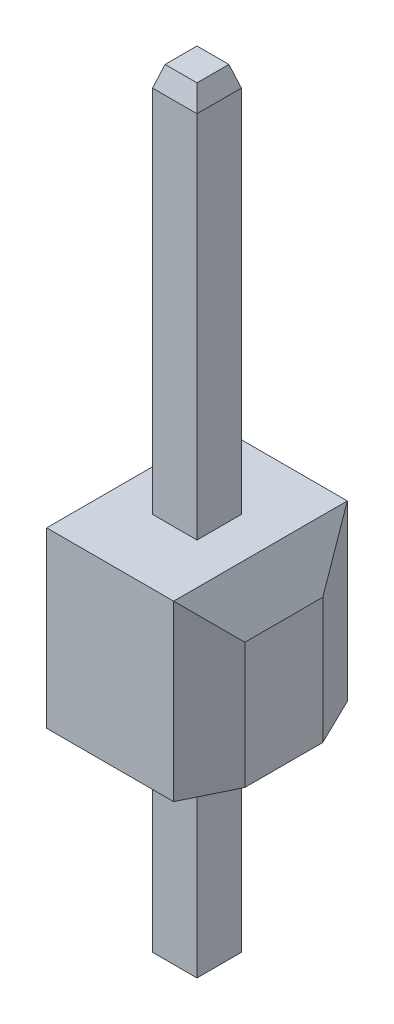
ISO-10303-21;
HEADER;
FILE_DESCRIPTION(('STEP AP214'),'2;1');
FILE_NAME('part.step','',(''),(''),'','','');
FILE_SCHEMA(('AUTOMOTIVE_DESIGN { 1 0 10303 214 1 1 1 1 }'));
ENDSEC;
DATA;
#1=APPLICATION_CONTEXT('core data for automotive mechanical design processes');
#2=APPLICATION_PROTOCOL_DEFINITION('international standard','automotive_design',2000,#1);
#3=PRODUCT_CONTEXT('',#1,'mechanical');
#4=PRODUCT('Part','Part','',(#3));
#5=PRODUCT_RELATED_PRODUCT_CATEGORY('part','',(#4));
#6=PRODUCT_DEFINITION_FORMATION('','',#4);
#7=PRODUCT_DEFINITION_CONTEXT('part definition',#1,'design');
#8=PRODUCT_DEFINITION('design','',#6,#7);
#9=PRODUCT_DEFINITION_SHAPE('','',#8);
#10=(LENGTH_UNIT() NAMED_UNIT(*) SI_UNIT(.MILLI.,.METRE.));
#11=(NAMED_UNIT(*) PLANE_ANGLE_UNIT() SI_UNIT($,.RADIAN.));
#12=(NAMED_UNIT(*) SI_UNIT($,.STERADIAN.) SOLID_ANGLE_UNIT());
#13=UNCERTAINTY_MEASURE_WITH_UNIT(LENGTH_MEASURE(1.E-05),#10,'distance_accuracy_value','');
#14=(GEOMETRIC_REPRESENTATION_CONTEXT(3) GLOBAL_UNCERTAINTY_ASSIGNED_CONTEXT((#13)) GLOBAL_UNIT_ASSIGNED_CONTEXT((#10,
#11,#12)) REPRESENTATION_CONTEXT('',''));
#15=CARTESIAN_POINT('',(0.,0.,0.));
#16=DIRECTION('',(0.,0.,1.));
#17=DIRECTION('',(1.,0.,0.));
#18=AXIS2_PLACEMENT_3D('',#15,#16,#17);
#19=CARTESIAN_POINT('',(1.27,2.54,1.27));
#20=DIRECTION('',(-1.,0.,0.));
#21=DIRECTION('',(0.,0.,1.));
#22=AXIS2_PLACEMENT_3D('',#19,#20,#21);
#23=PLANE('',#22);
#24=DIRECTION('',(0.,0.,-1.));
#25=VECTOR('',#24,1.);
#26=CARTESIAN_POINT('',(1.27,0.,1.27));
#27=LINE('',#26,#25);
#28=CARTESIAN_POINT('',(1.27,0.,0.569999999999992));
#29=VERTEX_POINT('',#28);
#30=CARTESIAN_POINT('',(1.27,0.,-0.569999999999992));
#31=VERTEX_POINT('',#30);
#32=EDGE_CURVE('E205',#29,#31,#27,.T.);
#33=ORIENTED_EDGE('',*,*,#32,.T.);
#34=DIRECTION('',(0.,1.,0.));
#35=VECTOR('',#34,1.);
#36=CARTESIAN_POINT('',(1.27,2.54,-0.569999999999992));
#37=LINE('',#36,#35);
#38=CARTESIAN_POINT('',(1.27,1.83999999999999,-0.569999999999992));
#39=VERTEX_POINT('',#38);
#40=EDGE_CURVE('E299',#31,#39,#37,.T.);
#41=ORIENTED_EDGE('',*,*,#40,.T.);
#42=DIRECTION('',(0.,0.,1.));
#43=VECTOR('',#42,1.);
#44=CARTESIAN_POINT('',(1.27,1.83999999999999,1.27));
#45=LINE('',#44,#43);
#46=CARTESIAN_POINT('',(1.27,1.83999999999999,0.569999999999992));
#47=VERTEX_POINT('',#46);
#48=EDGE_CURVE('E295',#39,#47,#45,.T.);
#49=ORIENTED_EDGE('',*,*,#48,.T.);
#50=DIRECTION('',(0.,-1.,0.));
#51=VECTOR('',#50,1.);
#52=CARTESIAN_POINT('',(1.27,2.54,0.569999999999992));
#53=LINE('',#52,#51);
#54=EDGE_CURVE('E297',#47,#29,#53,.T.);
#55=ORIENTED_EDGE('',*,*,#54,.T.);
#56=EDGE_LOOP('',(#33,#41,#49,#55));
#57=FACE_BOUND('',#56,.T.);
#58=ADVANCED_FACE('F34',(#57),#23,.F.);
#59=CARTESIAN_POINT('',(-1.27,2.54,-1.27));
#60=DIRECTION('',(0.,0.,1.));
#61=DIRECTION('',(1.,0.,0.));
#62=AXIS2_PLACEMENT_3D('',#59,#60,#61);
#63=PLANE('',#62);
#64=DIRECTION('',(-1.,0.,0.));
#65=VECTOR('',#64,1.);
#66=CARTESIAN_POINT('',(-1.27,0.,-1.27));
#67=LINE('',#66,#65);
#68=CARTESIAN_POINT('',(0.928587188003895,0.,-1.27));
#69=VERTEX_POINT('',#68);
#70=CARTESIAN_POINT('',(-0.928587188003895,0.,-1.27));
#71=VERTEX_POINT('',#70);
#72=EDGE_CURVE('E214',#69,#71,#67,.T.);
#73=ORIENTED_EDGE('',*,*,#72,.T.);
#74=DIRECTION('',(0.,1.,0.));
#75=VECTOR('',#74,1.);
#76=CARTESIAN_POINT('',(-0.928587188003895,2.54,-1.27));
#77=LINE('',#76,#75);
#78=CARTESIAN_POINT('',(-0.928587188003895,2.54,-1.27));
#79=VERTEX_POINT('',#78);
#80=EDGE_CURVE('E57',#71,#79,#77,.T.);
#81=ORIENTED_EDGE('',*,*,#80,.T.);
#82=DIRECTION('',(-1.,0.,0.));
#83=VECTOR('',#82,1.);
#84=CARTESIAN_POINT('',(-1.27,2.54,-1.27));
#85=LINE('',#84,#83);
#86=CARTESIAN_POINT('',(0.928587188003895,2.54,-1.27));
#87=VERTEX_POINT('',#86);
#88=EDGE_CURVE('E206',#87,#79,#85,.T.);
#89=ORIENTED_EDGE('',*,*,#88,.F.);
#90=DIRECTION('',(0.,-1.,0.));
#91=VECTOR('',#90,1.);
#92=CARTESIAN_POINT('',(0.928587188003895,2.54,-1.27));
#93=LINE('',#92,#91);
#94=EDGE_CURVE('E266',#87,#69,#93,.T.);
#95=ORIENTED_EDGE('',*,*,#94,.T.);
#96=EDGE_LOOP('',(#73,#81,#89,#95));
#97=FACE_BOUND('',#96,.T.);
#98=ADVANCED_FACE('F356',(#97),#63,.F.);
#99=CARTESIAN_POINT('',(-1.27,2.54,1.27));
#100=DIRECTION('',(1.,0.,0.));
#101=DIRECTION('',(0.,0.,-1.));
#102=AXIS2_PLACEMENT_3D('',#99,#100,#101);
#103=PLANE('',#102);
#104=DIRECTION('',(0.,0.,-1.));
#105=VECTOR('',#104,1.);
#106=CARTESIAN_POINT('',(-1.27,1.83999999999999,1.27));
#107=LINE('',#106,#105);
#108=CARTESIAN_POINT('',(-1.27,1.83999999999999,0.569999999999992));
#109=VERTEX_POINT('',#108);
#110=CARTESIAN_POINT('',(-1.27,1.83999999999999,-0.569999999999992));
#111=VERTEX_POINT('',#110);
#112=EDGE_CURVE('E306',#109,#111,#107,.T.);
#113=ORIENTED_EDGE('',*,*,#112,.T.);
#114=DIRECTION('',(0.,-1.,0.));
#115=VECTOR('',#114,1.);
#116=CARTESIAN_POINT('',(-1.27,2.54,-0.569999999999992));
#117=LINE('',#116,#115);
#118=CARTESIAN_POINT('',(-1.27,0.,-0.569999999999992));
#119=VERTEX_POINT('',#118);
#120=EDGE_CURVE('E315',#111,#119,#117,.T.);
#121=ORIENTED_EDGE('',*,*,#120,.T.);
#122=DIRECTION('',(0.,0.,1.));
#123=VECTOR('',#122,1.);
#124=CARTESIAN_POINT('',(-1.27,0.,1.27));
#125=LINE('',#124,#123);
#126=CARTESIAN_POINT('',(-1.27,0.,0.569999999999992));
#127=VERTEX_POINT('',#126);
#128=EDGE_CURVE('E216',#119,#127,#125,.T.);
#129=ORIENTED_EDGE('',*,*,#128,.T.);
#130=DIRECTION('',(0.,1.,0.));
#131=VECTOR('',#130,1.);
#132=CARTESIAN_POINT('',(-1.27,2.54,0.569999999999992));
#133=LINE('',#132,#131);
#134=EDGE_CURVE('E313',#127,#109,#133,.T.);
#135=ORIENTED_EDGE('',*,*,#134,.T.);
#136=EDGE_LOOP('',(#113,#121,#129,#135));
#137=FACE_BOUND('',#136,.T.);
#138=ADVANCED_FACE('F361',(#137),#103,.F.);
#139=CARTESIAN_POINT('',(-1.27,2.54,1.27));
#140=DIRECTION('',(0.,0.,-1.));
#141=DIRECTION('',(-1.,0.,0.));
#142=AXIS2_PLACEMENT_3D('',#139,#140,#141);
#143=PLANE('',#142);
#144=DIRECTION('',(1.,0.,0.));
#145=VECTOR('',#144,1.);
#146=CARTESIAN_POINT('',(-1.27,2.54,1.27));
#147=LINE('',#146,#145);
#148=CARTESIAN_POINT('',(-0.928587188003895,2.54,1.27));
#149=VERTEX_POINT('',#148);
#150=CARTESIAN_POINT('',(0.928587188003895,2.54,1.27));
#151=VERTEX_POINT('',#150);
#152=EDGE_CURVE('E208',#149,#151,#147,.T.);
#153=ORIENTED_EDGE('',*,*,#152,.F.);
#154=DIRECTION('',(0.,-1.,0.));
#155=VECTOR('',#154,1.);
#156=CARTESIAN_POINT('',(-0.928587188003895,2.54,1.27));
#157=LINE('',#156,#155);
#158=CARTESIAN_POINT('',(-0.928587188003895,0.,1.27));
#159=VERTEX_POINT('',#158);
#160=EDGE_CURVE('E43',#149,#159,#157,.T.);
#161=ORIENTED_EDGE('',*,*,#160,.T.);
#162=DIRECTION('',(1.,0.,0.));
#163=VECTOR('',#162,1.);
#164=CARTESIAN_POINT('',(-1.27,0.,1.27));
#165=LINE('',#164,#163);
#166=CARTESIAN_POINT('',(0.928587188003895,0.,1.27));
#167=VERTEX_POINT('',#166);
#168=EDGE_CURVE('E209',#159,#167,#165,.T.);
#169=ORIENTED_EDGE('',*,*,#168,.T.);
#170=DIRECTION('',(0.,1.,0.));
#171=VECTOR('',#170,1.);
#172=CARTESIAN_POINT('',(0.928587188003895,2.54,1.27));
#173=LINE('',#172,#171);
#174=EDGE_CURVE('E301',#167,#151,#173,.T.);
#175=ORIENTED_EDGE('',*,*,#174,.T.);
#176=EDGE_LOOP('',(#153,#161,#169,#175));
#177=FACE_BOUND('',#176,.T.);
#178=ADVANCED_FACE('F339',(#177),#143,.F.);
#179=CARTESIAN_POINT('',(0.,2.54,0.));
#180=DIRECTION('',(0.,-1.,0.));
#181=DIRECTION('',(0.,0.,-1.));
#182=AXIS2_PLACEMENT_3D('',#179,#180,#181);
#183=PLANE('',#182);
#184=DIRECTION('',(-1.,0.,0.));
#185=VECTOR('',#184,1.);
#186=CARTESIAN_POINT('',(0.,2.54,0.325));
#187=LINE('',#186,#185);
#188=CARTESIAN_POINT('',(0.325,2.54,0.325));
#189=VERTEX_POINT('',#188);
#190=CARTESIAN_POINT('',(-0.325,2.54,0.325));
#191=VERTEX_POINT('',#190);
#192=EDGE_CURVE('E173',#189,#191,#187,.T.);
#193=ORIENTED_EDGE('',*,*,#192,.T.);
#194=DIRECTION('',(0.,0.,-1.));
#195=VECTOR('',#194,1.);
#196=CARTESIAN_POINT('',(-0.325,2.54,0.));
#197=LINE('',#196,#195);
#198=CARTESIAN_POINT('',(-0.325,2.54,-0.325));
#199=VERTEX_POINT('',#198);
#200=EDGE_CURVE('E200',#191,#199,#197,.T.);
#201=ORIENTED_EDGE('',*,*,#200,.T.);
#202=DIRECTION('',(1.,0.,0.));
#203=VECTOR('',#202,1.);
#204=CARTESIAN_POINT('',(0.,2.54,-0.325));
#205=LINE('',#204,#203);
#206=CARTESIAN_POINT('',(0.325,2.54,-0.325));
#207=VERTEX_POINT('',#206);
#208=EDGE_CURVE('E198',#199,#207,#205,.T.);
#209=ORIENTED_EDGE('',*,*,#208,.T.);
#210=DIRECTION('',(0.,0.,1.));
#211=VECTOR('',#210,1.);
#212=CARTESIAN_POINT('',(0.325,2.54,0.));
#213=LINE('',#212,#211);
#214=EDGE_CURVE('E184',#207,#189,#213,.T.);
#215=ORIENTED_EDGE('',*,*,#214,.T.);
#216=EDGE_LOOP('',(#193,#201,#209,#215));
#217=FACE_BOUND('',#216,.T.);
#218=ORIENTED_EDGE('',*,*,#88,.T.);
#219=DIRECTION('',(0.,0.,1.));
#220=VECTOR('',#219,1.);
#221=CARTESIAN_POINT('',(-0.928587188003895,2.54,0.));
#222=LINE('',#221,#220);
#223=EDGE_CURVE('E11',#79,#149,#222,.T.);
#224=ORIENTED_EDGE('',*,*,#223,.T.);
#225=ORIENTED_EDGE('',*,*,#152,.T.);
#226=DIRECTION('',(0.,0.,-1.));
#227=VECTOR('',#226,1.);
#228=CARTESIAN_POINT('',(0.928587188003895,2.54,0.));
#229=LINE('',#228,#227);
#230=EDGE_CURVE('E304',#151,#87,#229,.T.);
#231=ORIENTED_EDGE('',*,*,#230,.T.);
#232=EDGE_LOOP('',(#218,#224,#225,#231));
#233=FACE_BOUND('',#232,.T.);
#234=ADVANCED_FACE('F197',(#217,#233),#183,.F.);
#235=CARTESIAN_POINT('',(0.,0.,0.));
#236=DIRECTION('',(0.,-1.,0.));
#237=DIRECTION('',(0.,0.,-1.));
#238=AXIS2_PLACEMENT_3D('',#235,#236,#237);
#239=PLANE('',#238);
#240=DIRECTION('',(0.,0.,-1.));
#241=VECTOR('',#240,1.);
#242=CARTESIAN_POINT('',(-0.325,0.,0.));
#243=LINE('',#242,#241);
#244=CARTESIAN_POINT('',(-0.325,0.,0.325));
#245=VERTEX_POINT('',#244);
#246=CARTESIAN_POINT('',(-0.325,0.,-0.325));
#247=VERTEX_POINT('',#246);
#248=EDGE_CURVE('E228',#245,#247,#243,.T.);
#249=ORIENTED_EDGE('',*,*,#248,.F.);
#250=DIRECTION('',(-1.,0.,0.));
#251=VECTOR('',#250,1.);
#252=CARTESIAN_POINT('',(0.,0.,0.325));
#253=LINE('',#252,#251);
#254=CARTESIAN_POINT('',(0.325,0.,0.325));
#255=VERTEX_POINT('',#254);
#256=EDGE_CURVE('E211',#255,#245,#253,.T.);
#257=ORIENTED_EDGE('',*,*,#256,.F.);
#258=DIRECTION('',(0.,0.,1.));
#259=VECTOR('',#258,1.);
#260=CARTESIAN_POINT('',(0.325,0.,0.));
#261=LINE('',#260,#259);
#262=CARTESIAN_POINT('',(0.325,0.,-0.325));
#263=VERTEX_POINT('',#262);
#264=EDGE_CURVE('E222',#263,#255,#261,.T.);
#265=ORIENTED_EDGE('',*,*,#264,.F.);
#266=DIRECTION('',(1.,0.,0.));
#267=VECTOR('',#266,1.);
#268=CARTESIAN_POINT('',(0.,0.,-0.325));
#269=LINE('',#268,#267);
#270=EDGE_CURVE('E225',#247,#263,#269,.T.);
#271=ORIENTED_EDGE('',*,*,#270,.F.);
#272=EDGE_LOOP('',(#249,#257,#265,#271));
#273=FACE_BOUND('',#272,.T.);
#274=ORIENTED_EDGE('',*,*,#128,.F.);
#275=DIRECTION('',(-0.438371146789076,0.,0.898794046299168));
#276=VECTOR('',#275,1.);
#277=CARTESIAN_POINT('',(-1.25052810160971,0.,-0.609923308072452));
#278=LINE('',#277,#276);
#279=EDGE_CURVE('E320',#119,#71,#278,.F.);
#280=ORIENTED_EDGE('',*,*,#279,.T.);
#281=ORIENTED_EDGE('',*,*,#72,.F.);
#282=DIRECTION('',(-0.438371146789076,0.,-0.898794046299168));
#283=VECTOR('',#282,1.);
#284=CARTESIAN_POINT('',(1.25052810160971,0.,-0.609923308072452));
#285=LINE('',#284,#283);
#286=EDGE_CURVE('E293',#69,#31,#285,.F.);
#287=ORIENTED_EDGE('',*,*,#286,.T.);
#288=ORIENTED_EDGE('',*,*,#32,.F.);
#289=DIRECTION('',(0.438371146789076,0.,-0.898794046299168));
#290=VECTOR('',#289,1.);
#291=CARTESIAN_POINT('',(1.25052810160971,0.,0.609923308072452));
#292=LINE('',#291,#290);
#293=EDGE_CURVE('E290',#29,#167,#292,.F.);
#294=ORIENTED_EDGE('',*,*,#293,.T.);
#295=ORIENTED_EDGE('',*,*,#168,.F.);
#296=DIRECTION('',(0.438371146789076,0.,0.898794046299168));
#297=VECTOR('',#296,1.);
#298=CARTESIAN_POINT('',(-1.25052810160971,0.,0.609923308072452));
#299=LINE('',#298,#297);
#300=EDGE_CURVE('E318',#159,#127,#299,.F.);
#301=ORIENTED_EDGE('',*,*,#300,.T.);
#302=EDGE_LOOP('',(#274,#280,#281,#287,#288,#294,#295,#301));
#303=FACE_BOUND('',#302,.T.);
#304=ADVANCED_FACE('F342',(#273,#303),#239,.T.);
#305=CARTESIAN_POINT('',(0.,-3.1,0.));
#306=DIRECTION('',(0.,1.,0.));
#307=DIRECTION('',(0.,0.,1.));
#308=AXIS2_PLACEMENT_3D('',#305,#306,#307);
#309=PLANE('',#308);
#310=DIRECTION('',(1.,0.,0.));
#311=VECTOR('',#310,1.);
#312=CARTESIAN_POINT('',(0.325,-3.1,-0.0249999999999984));
#313=LINE('',#312,#311);
#314=CARTESIAN_POINT('',(-0.0249999999999982,-3.1,-0.0249999999999983));
#315=VERTEX_POINT('',#314);
#316=CARTESIAN_POINT('',(0.0249999999999983,-3.1,-0.0249999999999983));
#317=VERTEX_POINT('',#316);
#318=EDGE_CURVE('E238',#315,#317,#313,.T.);
#319=ORIENTED_EDGE('',*,*,#318,.T.);
#320=DIRECTION('',(0.,0.,1.));
#321=VECTOR('',#320,1.);
#322=CARTESIAN_POINT('',(0.0249999999999983,-3.1,0.325));
#323=LINE('',#322,#321);
#324=CARTESIAN_POINT('',(0.0249999999999983,-3.1,0.0249999999999983));
#325=VERTEX_POINT('',#324);
#326=EDGE_CURVE('E240',#317,#325,#323,.T.);
#327=ORIENTED_EDGE('',*,*,#326,.T.);
#328=DIRECTION('',(-1.,0.,0.));
#329=VECTOR('',#328,1.);
#330=CARTESIAN_POINT('',(-0.325,-3.1,0.0249999999999984));
#331=LINE('',#330,#329);
#332=CARTESIAN_POINT('',(-0.0249999999999982,-3.1,0.0249999999999983));
#333=VERTEX_POINT('',#332);
#334=EDGE_CURVE('E236',#325,#333,#331,.T.);
#335=ORIENTED_EDGE('',*,*,#334,.T.);
#336=DIRECTION('',(0.,0.,-1.));
#337=VECTOR('',#336,1.);
#338=CARTESIAN_POINT('',(-0.0249999999999982,-3.1,-0.325));
#339=LINE('',#338,#337);
#340=EDGE_CURVE('E234',#333,#315,#339,.T.);
#341=ORIENTED_EDGE('',*,*,#340,.T.);
#342=EDGE_LOOP('',(#319,#327,#335,#341));
#343=FACE_BOUND('',#342,.T.);
#344=ADVANCED_FACE('F532',(#343),#309,.F.);
#345=CARTESIAN_POINT('',(0.325,-3.1,0.325));
#346=DIRECTION('',(0.,0.,1.));
#347=DIRECTION('',(1.,0.,0.));
#348=AXIS2_PLACEMENT_3D('',#345,#346,#347);
#349=PLANE('',#348);
#350=DIRECTION('',(0.,1.,0.));
#351=VECTOR('',#350,1.);
#352=CARTESIAN_POINT('',(-0.325,-3.1,0.325));
#353=LINE('',#352,#351);
#354=CARTESIAN_POINT('',(-0.325,-3.0082807955624,0.325));
#355=VERTEX_POINT('',#354);
#356=EDGE_CURVE('E194',#355,#245,#353,.T.);
#357=ORIENTED_EDGE('',*,*,#356,.F.);
#358=DIRECTION('',(1.,0.,0.));
#359=VECTOR('',#358,1.);
#360=CARTESIAN_POINT('',(0.325,-3.0082807955624,0.325));
#361=LINE('',#360,#359);
#362=CARTESIAN_POINT('',(0.325,-3.0082807955624,0.325));
#363=VERTEX_POINT('',#362);
#364=EDGE_CURVE('E245',#355,#363,#361,.T.);
#365=ORIENTED_EDGE('',*,*,#364,.T.);
#366=DIRECTION('',(0.,1.,0.));
#367=VECTOR('',#366,1.);
#368=CARTESIAN_POINT('',(0.325,-3.1,0.325));
#369=LINE('',#368,#367);
#370=EDGE_CURVE('E193',#363,#255,#369,.T.);
#371=ORIENTED_EDGE('',*,*,#370,.T.);
#372=ORIENTED_EDGE('',*,*,#256,.T.);
#373=EDGE_LOOP('',(#357,#365,#371,#372));
#374=FACE_BOUND('',#373,.T.);
#375=ADVANCED_FACE('F483',(#374),#349,.T.);
#376=CARTESIAN_POINT('',(0.325,-3.1,0.325));
#377=DIRECTION('',(1.,0.,0.));
#378=DIRECTION('',(0.,0.,-1.));
#379=AXIS2_PLACEMENT_3D('',#376,#377,#378);
#380=PLANE('',#379);
#381=ORIENTED_EDGE('',*,*,#370,.F.);
#382=DIRECTION('',(0.,0.,-1.));
#383=VECTOR('',#382,1.);
#384=CARTESIAN_POINT('',(0.325,-3.0082807955624,-0.325));
#385=LINE('',#384,#383);
#386=CARTESIAN_POINT('',(0.325,-3.0082807955624,-0.325));
#387=VERTEX_POINT('',#386);
#388=EDGE_CURVE('E231',#363,#387,#385,.T.);
#389=ORIENTED_EDGE('',*,*,#388,.T.);
#390=DIRECTION('',(0.,1.,0.));
#391=VECTOR('',#390,1.);
#392=CARTESIAN_POINT('',(0.325,-3.1,-0.325));
#393=LINE('',#392,#391);
#394=EDGE_CURVE('E642',#387,#263,#393,.T.);
#395=ORIENTED_EDGE('',*,*,#394,.T.);
#396=ORIENTED_EDGE('',*,*,#264,.T.);
#397=EDGE_LOOP('',(#381,#389,#395,#396));
#398=FACE_BOUND('',#397,.T.);
#399=ADVANCED_FACE('F491',(#398),#380,.T.);
#400=CARTESIAN_POINT('',(0.325,-3.1,-0.325));
#401=DIRECTION('',(0.,0.,-1.));
#402=DIRECTION('',(-1.,0.,0.));
#403=AXIS2_PLACEMENT_3D('',#400,#401,#402);
#404=PLANE('',#403);
#405=ORIENTED_EDGE('',*,*,#394,.F.);
#406=DIRECTION('',(-1.,0.,0.));
#407=VECTOR('',#406,1.);
#408=CARTESIAN_POINT('',(-0.325,-3.0082807955624,-0.325));
#409=LINE('',#408,#407);
#410=CARTESIAN_POINT('',(-0.325,-3.0082807955624,-0.325));
#411=VERTEX_POINT('',#410);
#412=EDGE_CURVE('E243',#387,#411,#409,.T.);
#413=ORIENTED_EDGE('',*,*,#412,.T.);
#414=DIRECTION('',(0.,1.,0.));
#415=VECTOR('',#414,1.);
#416=CARTESIAN_POINT('',(-0.325,-3.1,-0.325));
#417=LINE('',#416,#415);
#418=EDGE_CURVE('E185',#411,#247,#417,.T.);
#419=ORIENTED_EDGE('',*,*,#418,.T.);
#420=ORIENTED_EDGE('',*,*,#270,.T.);
#421=EDGE_LOOP('',(#405,#413,#419,#420));
#422=FACE_BOUND('',#421,.T.);
#423=ADVANCED_FACE('F500',(#422),#404,.T.);
#424=CARTESIAN_POINT('',(-0.325,-3.1,0.325));
#425=DIRECTION('',(-1.,0.,0.));
#426=DIRECTION('',(0.,0.,1.));
#427=AXIS2_PLACEMENT_3D('',#424,#425,#426);
#428=PLANE('',#427);
#429=ORIENTED_EDGE('',*,*,#418,.F.);
#430=DIRECTION('',(0.,0.,1.));
#431=VECTOR('',#430,1.);
#432=CARTESIAN_POINT('',(-0.325,-3.0082807955624,0.325));
#433=LINE('',#432,#431);
#434=EDGE_CURVE('E247',#411,#355,#433,.T.);
#435=ORIENTED_EDGE('',*,*,#434,.T.);
#436=ORIENTED_EDGE('',*,*,#356,.T.);
#437=ORIENTED_EDGE('',*,*,#248,.T.);
#438=EDGE_LOOP('',(#429,#435,#436,#437));
#439=FACE_BOUND('',#438,.T.);
#440=ADVANCED_FACE('F506',(#439),#428,.T.);
#441=CARTESIAN_POINT('',(-0.325,7.94,0.325));
#442=VERTEX_POINT('',#441);
#443=EDGE_CURVE('E179',#191,#442,#353,.T.);
#444=ORIENTED_EDGE('',*,*,#443,.T.);
#445=DIRECTION('',(0.,0.,-1.));
#446=VECTOR('',#445,1.);
#447=CARTESIAN_POINT('',(-0.325,7.94,0.325));
#448=LINE('',#447,#446);
#449=CARTESIAN_POINT('',(-0.325,7.94,-0.325));
#450=VERTEX_POINT('',#449);
#451=EDGE_CURVE('E261',#442,#450,#448,.T.);
#452=ORIENTED_EDGE('',*,*,#451,.T.);
#453=EDGE_CURVE('E656',#199,#450,#417,.T.);
#454=ORIENTED_EDGE('',*,*,#453,.F.);
#455=ORIENTED_EDGE('',*,*,#200,.F.);
#456=EDGE_LOOP('',(#444,#452,#454,#455));
#457=FACE_BOUND('',#456,.T.);
#458=ADVANCED_FACE('F497',(#457),#428,.T.);
#459=ORIENTED_EDGE('',*,*,#453,.T.);
#460=DIRECTION('',(1.,0.,0.));
#461=VECTOR('',#460,1.);
#462=CARTESIAN_POINT('',(0.325,7.94,-0.325));
#463=LINE('',#462,#461);
#464=CARTESIAN_POINT('',(0.325,7.94,-0.325));
#465=VERTEX_POINT('',#464);
#466=EDGE_CURVE('E258',#450,#465,#463,.T.);
#467=ORIENTED_EDGE('',*,*,#466,.T.);
#468=EDGE_CURVE('E641',#207,#465,#393,.T.);
#469=ORIENTED_EDGE('',*,*,#468,.F.);
#470=ORIENTED_EDGE('',*,*,#208,.F.);
#471=EDGE_LOOP('',(#459,#467,#469,#470));
#472=FACE_BOUND('',#471,.T.);
#473=ADVANCED_FACE('F489',(#472),#404,.T.);
#474=ORIENTED_EDGE('',*,*,#468,.T.);
#475=DIRECTION('',(0.,0.,1.));
#476=VECTOR('',#475,1.);
#477=CARTESIAN_POINT('',(0.325,7.94,0.325));
#478=LINE('',#477,#476);
#479=CARTESIAN_POINT('',(0.325,7.94,0.325));
#480=VERTEX_POINT('',#479);
#481=EDGE_CURVE('E192',#465,#480,#478,.T.);
#482=ORIENTED_EDGE('',*,*,#481,.T.);
#483=EDGE_CURVE('E176',#189,#480,#369,.T.);
#484=ORIENTED_EDGE('',*,*,#483,.F.);
#485=ORIENTED_EDGE('',*,*,#214,.F.);
#486=EDGE_LOOP('',(#474,#482,#484,#485));
#487=FACE_BOUND('',#486,.T.);
#488=ADVANCED_FACE('F189',(#487),#380,.T.);
#489=ORIENTED_EDGE('',*,*,#483,.T.);
#490=DIRECTION('',(-1.,0.,0.));
#491=VECTOR('',#490,1.);
#492=CARTESIAN_POINT('',(0.325,7.94,0.325));
#493=LINE('',#492,#491);
#494=EDGE_CURVE('E263',#480,#442,#493,.T.);
#495=ORIENTED_EDGE('',*,*,#494,.T.);
#496=ORIENTED_EDGE('',*,*,#443,.F.);
#497=ORIENTED_EDGE('',*,*,#192,.F.);
#498=EDGE_LOOP('',(#489,#495,#496,#497));
#499=FACE_BOUND('',#498,.T.);
#500=ADVANCED_FACE('F175',(#499),#349,.T.);
#501=CARTESIAN_POINT('',(0.,8.24,0.));
#502=DIRECTION('',(0.,1.,0.));
#503=DIRECTION('',(0.,0.,1.));
#504=AXIS2_PLACEMENT_3D('',#501,#502,#503);
#505=PLANE('',#504);
#506=DIRECTION('',(0.,0.,-1.));
#507=VECTOR('',#506,1.);
#508=CARTESIAN_POINT('',(0.233280795562402,8.24,0.));
#509=LINE('',#508,#507);
#510=CARTESIAN_POINT('',(0.233280795562402,8.24,0.233280795562401));
#511=VERTEX_POINT('',#510);
#512=CARTESIAN_POINT('',(0.233280795562402,8.24,-0.233280795562402));
#513=VERTEX_POINT('',#512);
#514=EDGE_CURVE('E249',#511,#513,#509,.T.);
#515=ORIENTED_EDGE('',*,*,#514,.T.);
#516=DIRECTION('',(-1.,0.,0.));
#517=VECTOR('',#516,1.);
#518=CARTESIAN_POINT('',(0.,8.24,-0.233280795562401));
#519=LINE('',#518,#517);
#520=CARTESIAN_POINT('',(-0.233280795562402,8.24,-0.233280795562401));
#521=VERTEX_POINT('',#520);
#522=EDGE_CURVE('E255',#513,#521,#519,.T.);
#523=ORIENTED_EDGE('',*,*,#522,.T.);
#524=DIRECTION('',(0.,0.,1.));
#525=VECTOR('',#524,1.);
#526=CARTESIAN_POINT('',(-0.233280795562401,8.24,0.));
#527=LINE('',#526,#525);
#528=CARTESIAN_POINT('',(-0.233280795562401,8.24,0.233280795562402));
#529=VERTEX_POINT('',#528);
#530=EDGE_CURVE('E253',#521,#529,#527,.T.);
#531=ORIENTED_EDGE('',*,*,#530,.T.);
#532=DIRECTION('',(1.,0.,0.));
#533=VECTOR('',#532,1.);
#534=CARTESIAN_POINT('',(0.,8.24,0.233280795562402));
#535=LINE('',#534,#533);
#536=EDGE_CURVE('E251',#529,#511,#535,.T.);
#537=ORIENTED_EDGE('',*,*,#536,.T.);
#538=EDGE_LOOP('',(#515,#523,#531,#537));
#539=FACE_BOUND('',#538,.T.);
#540=ADVANCED_FACE('F392',(#539),#505,.T.);
#541=CARTESIAN_POINT('',(-0.325,-3.0082807955624,0.325));
#542=DIRECTION('',(-0.292371704722735,-0.956304755963036,0.));
#543=DIRECTION('',(0.,0.,-1.));
#544=AXIS2_PLACEMENT_3D('',#541,#542,#543);
#545=PLANE('',#544);
#546=DIRECTION('',(0.691140749344681,-0.211302932280997,0.69114074934468));
#547=VECTOR('',#546,1.);
#548=CARTESIAN_POINT('',(-0.014510901986928,-3.10320683908342,-0.0145109019869281));
#549=LINE('',#548,#547);
#550=EDGE_CURVE('E272',#315,#411,#549,.F.);
#551=ORIENTED_EDGE('',*,*,#550,.F.);
#552=ORIENTED_EDGE('',*,*,#340,.F.);
#553=DIRECTION('',(-0.69114074934468,0.211302932280997,0.69114074934468));
#554=VECTOR('',#553,1.);
#555=CARTESIAN_POINT('',(-0.325,-3.0082807955624,0.325));
#556=LINE('',#555,#554);
#557=EDGE_CURVE('E275',#355,#333,#556,.F.);
#558=ORIENTED_EDGE('',*,*,#557,.F.);
#559=ORIENTED_EDGE('',*,*,#434,.F.);
#560=EDGE_LOOP('',(#551,#552,#558,#559));
#561=FACE_BOUND('',#560,.T.);
#562=ADVANCED_FACE('F388',(#561),#545,.T.);
#563=CARTESIAN_POINT('',(0.325,-3.0082807955624,0.325));
#564=DIRECTION('',(0.,-0.956304755963036,0.292371704722735));
#565=DIRECTION('',(-1.,0.,0.));
#566=AXIS2_PLACEMENT_3D('',#563,#564,#565);
#567=PLANE('',#566);
#568=ORIENTED_EDGE('',*,*,#557,.T.);
#569=ORIENTED_EDGE('',*,*,#334,.F.);
#570=DIRECTION('',(0.69114074934468,0.211302932280997,0.69114074934468));
#571=VECTOR('',#570,1.);
#572=CARTESIAN_POINT('',(0.325,-3.0082807955624,0.325));
#573=LINE('',#572,#571);
#574=EDGE_CURVE('E269',#363,#325,#573,.F.);
#575=ORIENTED_EDGE('',*,*,#574,.F.);
#576=ORIENTED_EDGE('',*,*,#364,.F.);
#577=EDGE_LOOP('',(#568,#569,#575,#576));
#578=FACE_BOUND('',#577,.T.);
#579=ADVANCED_FACE('F384',(#578),#567,.T.);
#580=CARTESIAN_POINT('',(0.325,-3.0082807955624,-0.325));
#581=DIRECTION('',(0.,-0.956304755963036,-0.292371704722735));
#582=DIRECTION('',(1.,0.,0.));
#583=AXIS2_PLACEMENT_3D('',#580,#581,#582);
#584=PLANE('',#583);
#585=ORIENTED_EDGE('',*,*,#550,.T.);
#586=ORIENTED_EDGE('',*,*,#412,.F.);
#587=DIRECTION('',(-0.69114074934468,-0.211302932280997,0.69114074934468));
#588=VECTOR('',#587,1.);
#589=CARTESIAN_POINT('',(0.325,-3.0082807955624,-0.325));
#590=LINE('',#589,#588);
#591=EDGE_CURVE('E267',#317,#387,#590,.F.);
#592=ORIENTED_EDGE('',*,*,#591,.F.);
#593=ORIENTED_EDGE('',*,*,#318,.F.);
#594=EDGE_LOOP('',(#585,#586,#592,#593));
#595=FACE_BOUND('',#594,.T.);
#596=ADVANCED_FACE('F380',(#595),#584,.T.);
#597=CARTESIAN_POINT('',(0.325,-3.0082807955624,0.325));
#598=DIRECTION('',(0.292371704722735,-0.956304755963036,0.));
#599=DIRECTION('',(0.,0.,1.));
#600=AXIS2_PLACEMENT_3D('',#597,#598,#599);
#601=PLANE('',#600);
#602=ORIENTED_EDGE('',*,*,#574,.T.);
#603=ORIENTED_EDGE('',*,*,#326,.F.);
#604=ORIENTED_EDGE('',*,*,#591,.T.);
#605=ORIENTED_EDGE('',*,*,#388,.F.);
#606=EDGE_LOOP('',(#602,#603,#604,#605));
#607=FACE_BOUND('',#606,.T.);
#608=ADVANCED_FACE('F376',(#607),#601,.T.);
#609=CARTESIAN_POINT('',(0.,8.24,0.233280795562402));
#610=DIRECTION('',(0.,-0.292371704722735,-0.956304755963036));
#611=DIRECTION('',(1.,0.,0.));
#612=AXIS2_PLACEMENT_3D('',#609,#610,#611);
#613=PLANE('',#612);
#614=DIRECTION('',(-0.280623595142126,-0.917878420979062,0.280623595142126));
#615=VECTOR('',#614,1.);
#616=CARTESIAN_POINT('',(-0.214910025722512,8.30008808063437,0.214910025722512));
#617=LINE('',#616,#615);
#618=EDGE_CURVE('E283',#442,#529,#617,.F.);
#619=ORIENTED_EDGE('',*,*,#618,.F.);
#620=ORIENTED_EDGE('',*,*,#494,.F.);
#621=DIRECTION('',(0.280623595142126,-0.917878420979062,0.280623595142126));
#622=VECTOR('',#621,1.);
#623=CARTESIAN_POINT('',(0.214910025722512,8.30008808063437,0.214910025722512));
#624=LINE('',#623,#622);
#625=EDGE_CURVE('E270',#511,#480,#624,.T.);
#626=ORIENTED_EDGE('',*,*,#625,.F.);
#627=ORIENTED_EDGE('',*,*,#536,.F.);
#628=EDGE_LOOP('',(#619,#620,#626,#627));
#629=FACE_BOUND('',#628,.T.);
#630=ADVANCED_FACE('F379',(#629),#613,.F.);
#631=CARTESIAN_POINT('',(0.233280795562402,8.24,0.));
#632=DIRECTION('',(-0.956304755963036,-0.292371704722735,0.));
#633=DIRECTION('',(0.,0.,-1.));
#634=AXIS2_PLACEMENT_3D('',#631,#632,#633);
#635=PLANE('',#634);
#636=ORIENTED_EDGE('',*,*,#625,.T.);
#637=ORIENTED_EDGE('',*,*,#481,.F.);
#638=DIRECTION('',(-0.280623595142126,0.917878420979062,0.280623595142126));
#639=VECTOR('',#638,1.);
#640=CARTESIAN_POINT('',(0.214910025722512,8.30008808063437,-0.214910025722512));
#641=LINE('',#640,#639);
#642=EDGE_CURVE('E280',#513,#465,#641,.F.);
#643=ORIENTED_EDGE('',*,*,#642,.F.);
#644=ORIENTED_EDGE('',*,*,#514,.F.);
#645=EDGE_LOOP('',(#636,#637,#643,#644));
#646=FACE_BOUND('',#645,.T.);
#647=ADVANCED_FACE('F401',(#646),#635,.F.);
#648=CARTESIAN_POINT('',(-0.233280795562401,8.24,0.));
#649=DIRECTION('',(0.956304755963036,-0.292371704722735,0.));
#650=DIRECTION('',(0.,0.,1.));
#651=AXIS2_PLACEMENT_3D('',#648,#649,#650);
#652=PLANE('',#651);
#653=ORIENTED_EDGE('',*,*,#618,.T.);
#654=ORIENTED_EDGE('',*,*,#530,.F.);
#655=DIRECTION('',(-0.280623595142126,-0.917878420979062,-0.280623595142126));
#656=VECTOR('',#655,1.);
#657=CARTESIAN_POINT('',(-0.214910025722512,8.30008808063437,-0.214910025722512));
#658=LINE('',#657,#656);
#659=EDGE_CURVE('E278',#450,#521,#658,.F.);
#660=ORIENTED_EDGE('',*,*,#659,.F.);
#661=ORIENTED_EDGE('',*,*,#451,.F.);
#662=EDGE_LOOP('',(#653,#654,#660,#661));
#663=FACE_BOUND('',#662,.T.);
#664=ADVANCED_FACE('F397',(#663),#652,.F.);
#665=CARTESIAN_POINT('',(0.,8.24,-0.233280795562401));
#666=DIRECTION('',(0.,-0.292371704722735,0.956304755963036));
#667=DIRECTION('',(-1.,0.,0.));
#668=AXIS2_PLACEMENT_3D('',#665,#666,#667);
#669=PLANE('',#668);
#670=ORIENTED_EDGE('',*,*,#642,.T.);
#671=ORIENTED_EDGE('',*,*,#466,.F.);
#672=ORIENTED_EDGE('',*,*,#659,.T.);
#673=ORIENTED_EDGE('',*,*,#522,.F.);
#674=EDGE_LOOP('',(#670,#671,#672,#673));
#675=FACE_BOUND('',#674,.T.);
#676=ADVANCED_FACE('F394',(#675),#669,.F.);
#677=CARTESIAN_POINT('',(1.27,2.54,0.569999999999992));
#678=DIRECTION('',(-0.898794046299168,0.,-0.438371146789076));
#679=DIRECTION('',(0.,-1.,0.));
#680=AXIS2_PLACEMENT_3D('',#677,#678,#679);
#681=PLANE('',#680);
#682=ORIENTED_EDGE('',*,*,#293,.F.);
#683=ORIENTED_EDGE('',*,*,#54,.F.);
#684=DIRECTION('',(0.326034139782525,-0.668469049282115,-0.668469049282115));
#685=VECTOR('',#684,1.);
#686=CARTESIAN_POINT('',(1.20537572695039,1.97249939529287,0.702499395292869));
#687=LINE('',#686,#685);
#688=EDGE_CURVE('E281',#151,#47,#687,.T.);
#689=ORIENTED_EDGE('',*,*,#688,.F.);
#690=ORIENTED_EDGE('',*,*,#174,.F.);
#691=EDGE_LOOP('',(#682,#683,#689,#690));
#692=FACE_BOUND('',#691,.T.);
#693=ADVANCED_FACE('F349',(#692),#681,.F.);
#694=CARTESIAN_POINT('',(0.928587188003895,2.54,0.));
#695=DIRECTION('',(-0.898794046299168,-0.438371146789076,0.));
#696=DIRECTION('',(0.,0.,-1.));
#697=AXIS2_PLACEMENT_3D('',#694,#695,#696);
#698=PLANE('',#697);
#699=ORIENTED_EDGE('',*,*,#688,.T.);
#700=ORIENTED_EDGE('',*,*,#48,.F.);
#701=DIRECTION('',(-0.326034139782525,0.668469049282115,-0.668469049282115));
#702=VECTOR('',#701,1.);
#703=CARTESIAN_POINT('',(1.20537572695039,1.97249939529287,-0.702499395292869));
#704=LINE('',#703,#702);
#705=EDGE_CURVE('E307',#87,#39,#704,.F.);
#706=ORIENTED_EDGE('',*,*,#705,.F.);
#707=ORIENTED_EDGE('',*,*,#230,.F.);
#708=EDGE_LOOP('',(#699,#700,#706,#707));
#709=FACE_BOUND('',#708,.T.);
#710=ADVANCED_FACE('F354',(#709),#698,.F.);
#711=CARTESIAN_POINT('',(0.928587188003895,2.54,-1.27));
#712=DIRECTION('',(-0.898794046299168,0.,0.438371146789076));
#713=DIRECTION('',(0.,-1.,0.));
#714=AXIS2_PLACEMENT_3D('',#711,#712,#713);
#715=PLANE('',#714);
#716=ORIENTED_EDGE('',*,*,#705,.T.);
#717=ORIENTED_EDGE('',*,*,#40,.F.);
#718=ORIENTED_EDGE('',*,*,#286,.F.);
#719=ORIENTED_EDGE('',*,*,#94,.F.);
#720=EDGE_LOOP('',(#716,#717,#718,#719));
#721=FACE_BOUND('',#720,.T.);
#722=ADVANCED_FACE('F409',(#721),#715,.F.);
#723=CARTESIAN_POINT('',(-0.928587188003895,2.54,1.27));
#724=DIRECTION('',(0.898794046299168,0.,-0.438371146789076));
#725=DIRECTION('',(0.,-1.,0.));
#726=AXIS2_PLACEMENT_3D('',#723,#724,#725);
#727=PLANE('',#726);
#728=ORIENTED_EDGE('',*,*,#300,.F.);
#729=ORIENTED_EDGE('',*,*,#160,.F.);
#730=DIRECTION('',(0.326034139782525,0.668469049282115,0.668469049282115));
#731=VECTOR('',#730,1.);
#732=CARTESIAN_POINT('',(-1.20537572695039,1.97249939529287,0.702499395292869));
#733=LINE('',#732,#731);
#734=EDGE_CURVE('E38',#109,#149,#733,.T.);
#735=ORIENTED_EDGE('',*,*,#734,.F.);
#736=ORIENTED_EDGE('',*,*,#134,.F.);
#737=EDGE_LOOP('',(#728,#729,#735,#736));
#738=FACE_BOUND('',#737,.T.);
#739=ADVANCED_FACE('F36',(#738),#727,.F.);
#740=CARTESIAN_POINT('',(-0.928587188003895,2.54,0.));
#741=DIRECTION('',(0.898794046299168,-0.438371146789076,0.));
#742=DIRECTION('',(0.,0.,1.));
#743=AXIS2_PLACEMENT_3D('',#740,#741,#742);
#744=PLANE('',#743);
#745=ORIENTED_EDGE('',*,*,#734,.T.);
#746=ORIENTED_EDGE('',*,*,#223,.F.);
#747=DIRECTION('',(-0.326034139782525,-0.668469049282115,0.668469049282115));
#748=VECTOR('',#747,1.);
#749=CARTESIAN_POINT('',(-1.20537572695039,1.97249939529287,-0.702499395292869));
#750=LINE('',#749,#748);
#751=EDGE_CURVE('E323',#111,#79,#750,.F.);
#752=ORIENTED_EDGE('',*,*,#751,.F.);
#753=ORIENTED_EDGE('',*,*,#112,.F.);
#754=EDGE_LOOP('',(#745,#746,#752,#753));
#755=FACE_BOUND('',#754,.T.);
#756=ADVANCED_FACE('F332',(#755),#744,.F.);
#757=CARTESIAN_POINT('',(-1.27,2.54,-0.569999999999992));
#758=DIRECTION('',(0.898794046299168,0.,0.438371146789076));
#759=DIRECTION('',(0.,-1.,0.));
#760=AXIS2_PLACEMENT_3D('',#757,#758,#759);
#761=PLANE('',#760);
#762=ORIENTED_EDGE('',*,*,#751,.T.);
#763=ORIENTED_EDGE('',*,*,#80,.F.);
#764=ORIENTED_EDGE('',*,*,#279,.F.);
#765=ORIENTED_EDGE('',*,*,#120,.F.);
#766=EDGE_LOOP('',(#762,#763,#764,#765));
#767=FACE_BOUND('',#766,.T.);
#768=ADVANCED_FACE('F359',(#767),#761,.F.);
#769=CLOSED_SHELL('',(#58,#98,#138,#178,#234,#304,#344,#375,#399,#423,#440,#458,#473,#488,#500,
#540,#562,#579,#596,#608,#630,#647,#664,#676,#693,#710,#722,#739,#756,#768));
#770=MANIFOLD_SOLID_BREP('B2',#769);
#771=ADVANCED_BREP_SHAPE_REPRESENTATION('',(#18,#770),#14);
#772=SHAPE_DEFINITION_REPRESENTATION(#9,#771);
ENDSEC;
END-ISO-10303-21;
